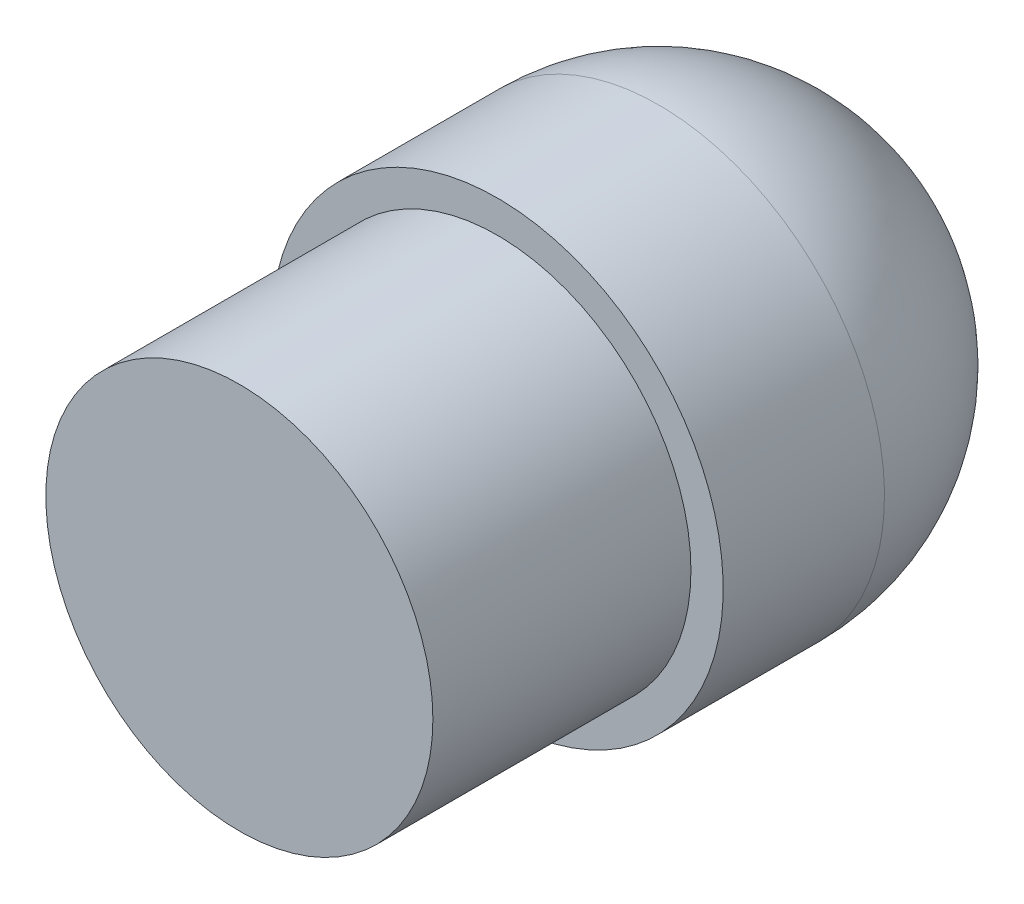
ISO-10303-21;
HEADER;
FILE_DESCRIPTION(('STEP AP214'),'2;1');
FILE_NAME('part.step','',(''),(''),'','','');
FILE_SCHEMA(('AUTOMOTIVE_DESIGN { 1 0 10303 214 1 1 1 1 }'));
ENDSEC;
DATA;
#1=APPLICATION_CONTEXT('core data for automotive mechanical design processes');
#2=APPLICATION_PROTOCOL_DEFINITION('international standard','automotive_design',2000,#1);
#3=PRODUCT_CONTEXT('',#1,'mechanical');
#4=PRODUCT('Part','Part','',(#3));
#5=PRODUCT_RELATED_PRODUCT_CATEGORY('part','',(#4));
#6=PRODUCT_DEFINITION_FORMATION('','',#4);
#7=PRODUCT_DEFINITION_CONTEXT('part definition',#1,'design');
#8=PRODUCT_DEFINITION('design','',#6,#7);
#9=PRODUCT_DEFINITION_SHAPE('','',#8);
#10=(LENGTH_UNIT() NAMED_UNIT(*) SI_UNIT(.MILLI.,.METRE.));
#11=(NAMED_UNIT(*) PLANE_ANGLE_UNIT() SI_UNIT($,.RADIAN.));
#12=(NAMED_UNIT(*) SI_UNIT($,.STERADIAN.) SOLID_ANGLE_UNIT());
#13=UNCERTAINTY_MEASURE_WITH_UNIT(LENGTH_MEASURE(1.E-05),#10,'distance_accuracy_value','');
#14=(GEOMETRIC_REPRESENTATION_CONTEXT(3) GLOBAL_UNCERTAINTY_ASSIGNED_CONTEXT((#13)) GLOBAL_UNIT_ASSIGNED_CONTEXT((#10,
#11,#12)) REPRESENTATION_CONTEXT('',''));
#15=CARTESIAN_POINT('',(0.,0.,0.));
#16=DIRECTION('',(0.,0.,1.));
#17=DIRECTION('',(1.,0.,0.));
#18=AXIS2_PLACEMENT_3D('',#15,#16,#17);
#19=CARTESIAN_POINT('',(0.,0.,-20.));
#20=DIRECTION('',(0.,0.,1.));
#21=DIRECTION('',(1.,0.,0.));
#22=AXIS2_PLACEMENT_3D('',#19,#20,#21);
#23=CYLINDRICAL_SURFACE('',#22,15.);
#24=CARTESIAN_POINT('',(0.,0.,-20.));
#25=DIRECTION('',(0.,0.,1.));
#26=DIRECTION('',(1.,0.,0.));
#27=AXIS2_PLACEMENT_3D('',#24,#25,#26);
#28=CIRCLE('',#27,15.);
#29=CARTESIAN_POINT('',(15.,0.,-20.));
#30=VERTEX_POINT('',#29);
#31=EDGE_CURVE('E48',#30,#30,#28,.T.);
#32=ORIENTED_EDGE('',*,*,#31,.T.);
#33=EDGE_LOOP('',(#32));
#34=FACE_BOUND('',#33,.T.);
#35=CARTESIAN_POINT('',(0.,0.,0.));
#36=DIRECTION('',(0.,0.,1.));
#37=DIRECTION('',(1.,0.,0.));
#38=AXIS2_PLACEMENT_3D('',#35,#36,#37);
#39=CIRCLE('',#38,15.);
#40=CARTESIAN_POINT('',(15.,0.,0.));
#41=VERTEX_POINT('',#40);
#42=EDGE_CURVE('E10',#41,#41,#39,.T.);
#43=ORIENTED_EDGE('',*,*,#42,.F.);
#44=EDGE_LOOP('',(#43));
#45=FACE_BOUND('',#44,.T.);
#46=ADVANCED_FACE('F41',(#34,#45),#23,.T.);
#47=CARTESIAN_POINT('',(0.,0.,0.));
#48=DIRECTION('',(0.,0.,1.));
#49=DIRECTION('',(1.,0.,0.));
#50=AXIS2_PLACEMENT_3D('',#47,#48,#49);
#51=PLANE('',#50);
#52=ORIENTED_EDGE('',*,*,#42,.T.);
#53=EDGE_LOOP('',(#52));
#54=FACE_BOUND('',#53,.T.);
#55=ADVANCED_FACE('F78',(#54),#51,.T.);
#56=CARTESIAN_POINT('',(0.,0.,-32.5));
#57=DIRECTION('',(0.,0.,1.));
#58=DIRECTION('',(1.,0.,0.));
#59=AXIS2_PLACEMENT_3D('',#56,#57,#58);
#60=CYLINDRICAL_SURFACE('',#59,17.5);
#61=CARTESIAN_POINT('',(0.,0.,-32.5));
#62=DIRECTION('',(0.,0.,-1.));
#63=DIRECTION('',(-1.,0.,0.));
#64=AXIS2_PLACEMENT_3D('',#61,#62,#63);
#65=CIRCLE('',#64,17.5);
#66=CARTESIAN_POINT('',(-17.5,0.,-32.5));
#67=VERTEX_POINT('',#66);
#68=EDGE_CURVE('E53',#67,#67,#65,.T.);
#69=ORIENTED_EDGE('',*,*,#68,.F.);
#70=EDGE_LOOP('',(#69));
#71=FACE_BOUND('',#70,.T.);
#72=CARTESIAN_POINT('',(0.,0.,-20.));
#73=DIRECTION('',(0.,0.,-1.));
#74=DIRECTION('',(-1.,0.,0.));
#75=AXIS2_PLACEMENT_3D('',#72,#73,#74);
#76=CIRCLE('',#75,17.5);
#77=CARTESIAN_POINT('',(-17.5,0.,-20.));
#78=VERTEX_POINT('',#77);
#79=EDGE_CURVE('E58',#78,#78,#76,.T.);
#80=ORIENTED_EDGE('',*,*,#79,.T.);
#81=EDGE_LOOP('',(#80));
#82=FACE_BOUND('',#81,.T.);
#83=ADVANCED_FACE('F65',(#71,#82),#60,.T.);
#84=CARTESIAN_POINT('',(0.,0.,-20.));
#85=DIRECTION('',(0.,0.,-1.));
#86=DIRECTION('',(-1.,0.,0.));
#87=AXIS2_PLACEMENT_3D('',#84,#85,#86);
#88=PLANE('',#87);
#89=ORIENTED_EDGE('',*,*,#31,.F.);
#90=EDGE_LOOP('',(#89));
#91=FACE_BOUND('',#90,.T.);
#92=ORIENTED_EDGE('',*,*,#79,.F.);
#93=EDGE_LOOP('',(#92));
#94=FACE_BOUND('',#93,.T.);
#95=ADVANCED_FACE('F67',(#91,#94),#88,.F.);
#96=CARTESIAN_POINT('',(0.,0.,-32.5));
#97=DIRECTION('',(0.,0.,1.));
#98=DIRECTION('',(0.,-1.,0.));
#99=AXIS2_PLACEMENT_3D('',#96,#97,#98);
#100=SPHERICAL_SURFACE('',#99,17.5);
#101=ORIENTED_EDGE('',*,*,#68,.T.);
#102=EDGE_LOOP('',(#101));
#103=FACE_BOUND('',#102,.T.);
#104=ADVANCED_FACE('F69',(#103),#100,.T.);
#105=CLOSED_SHELL('',(#46,#55,#83,#95,#104));
#106=MANIFOLD_SOLID_BREP('B2',#105);
#107=ADVANCED_BREP_SHAPE_REPRESENTATION('',(#18,#106),#14);
#108=SHAPE_DEFINITION_REPRESENTATION(#9,#107);
ENDSEC;
END-ISO-10303-21;
